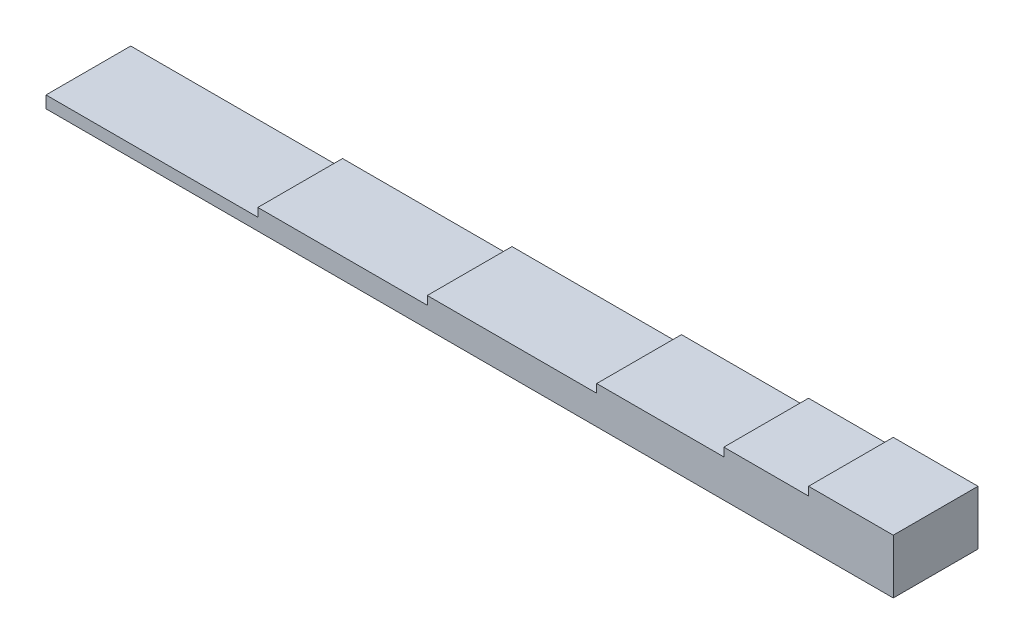
ISO-10303-21;
HEADER;
FILE_DESCRIPTION(('STEP AP214'),'2;1');
FILE_NAME('part.step','',(''),(''),'','','');
FILE_SCHEMA(('AUTOMOTIVE_DESIGN { 1 0 10303 214 1 1 1 1 }'));
ENDSEC;
DATA;
#1=APPLICATION_CONTEXT('core data for automotive mechanical design processes');
#2=APPLICATION_PROTOCOL_DEFINITION('international standard','automotive_design',2000,#1);
#3=PRODUCT_CONTEXT('',#1,'mechanical');
#4=PRODUCT('Part','Part','',(#3));
#5=PRODUCT_RELATED_PRODUCT_CATEGORY('part','',(#4));
#6=PRODUCT_DEFINITION_FORMATION('','',#4);
#7=PRODUCT_DEFINITION_CONTEXT('part definition',#1,'design');
#8=PRODUCT_DEFINITION('design','',#6,#7);
#9=PRODUCT_DEFINITION_SHAPE('','',#8);
#10=(LENGTH_UNIT() NAMED_UNIT(*) SI_UNIT(.MILLI.,.METRE.));
#11=(NAMED_UNIT(*) PLANE_ANGLE_UNIT() SI_UNIT($,.RADIAN.));
#12=(NAMED_UNIT(*) SI_UNIT($,.STERADIAN.) SOLID_ANGLE_UNIT());
#13=UNCERTAINTY_MEASURE_WITH_UNIT(LENGTH_MEASURE(1.E-05),#10,'distance_accuracy_value','');
#14=(GEOMETRIC_REPRESENTATION_CONTEXT(3) GLOBAL_UNCERTAINTY_ASSIGNED_CONTEXT((#13)) GLOBAL_UNIT_ASSIGNED_CONTEXT((#10,
#11,#12)) REPRESENTATION_CONTEXT('',''));
#15=CARTESIAN_POINT('',(0.,0.,0.));
#16=DIRECTION('',(0.,0.,1.));
#17=DIRECTION('',(1.,0.,0.));
#18=AXIS2_PLACEMENT_3D('',#15,#16,#17);
#19=CARTESIAN_POINT('',(75.,0.,10.));
#20=DIRECTION('',(1.,0.,0.));
#21=DIRECTION('',(0.,0.,-1.));
#22=AXIS2_PLACEMENT_3D('',#19,#20,#21);
#23=PLANE('',#22);
#24=DIRECTION('',(0.,-1.,0.));
#25=VECTOR('',#24,1.);
#26=CARTESIAN_POINT('',(75.,0.,0.));
#27=LINE('',#26,#25);
#28=CARTESIAN_POINT('',(75.,4.,0.));
#29=VERTEX_POINT('',#28);
#30=CARTESIAN_POINT('',(75.,-2.42151928856505,0.));
#31=VERTEX_POINT('',#30);
#32=EDGE_CURVE('E135',#29,#31,#27,.T.);
#33=ORIENTED_EDGE('',*,*,#32,.F.);
#34=DIRECTION('',(0.,0.,-1.));
#35=VECTOR('',#34,1.);
#36=CARTESIAN_POINT('',(75.,4.,10.));
#37=LINE('',#36,#35);
#38=CARTESIAN_POINT('',(75.,4.,10.));
#39=VERTEX_POINT('',#38);
#40=EDGE_CURVE('E11',#39,#29,#37,.T.);
#41=ORIENTED_EDGE('',*,*,#40,.F.);
#42=DIRECTION('',(0.,-1.,0.));
#43=VECTOR('',#42,1.);
#44=CARTESIAN_POINT('',(75.,0.,10.));
#45=LINE('',#44,#43);
#46=CARTESIAN_POINT('',(75.,-2.42151928856505,10.));
#47=VERTEX_POINT('',#46);
#48=EDGE_CURVE('E231',#39,#47,#45,.T.);
#49=ORIENTED_EDGE('',*,*,#48,.T.);
#50=DIRECTION('',(0.,0.,-1.));
#51=VECTOR('',#50,1.);
#52=CARTESIAN_POINT('',(75.,-2.42151928856505,10.));
#53=LINE('',#52,#51);
#54=EDGE_CURVE('E147',#47,#31,#53,.T.);
#55=ORIENTED_EDGE('',*,*,#54,.T.);
#56=EDGE_LOOP('',(#33,#41,#49,#55));
#57=FACE_BOUND('',#56,.T.);
#58=ADVANCED_FACE('F39',(#57),#23,.T.);
#59=CARTESIAN_POINT('',(0.,3.99999999999999,10.));
#60=DIRECTION('',(0.,1.,0.));
#61=DIRECTION('',(-1.,0.,0.));
#62=AXIS2_PLACEMENT_3D('',#59,#60,#61);
#63=PLANE('',#62);
#64=DIRECTION('',(1.,0.,0.));
#65=VECTOR('',#64,1.);
#66=CARTESIAN_POINT('',(0.,3.99999999999999,0.));
#67=LINE('',#66,#65);
#68=CARTESIAN_POINT('',(65.,4.,0.));
#69=VERTEX_POINT('',#68);
#70=EDGE_CURVE('E199',#69,#29,#67,.T.);
#71=ORIENTED_EDGE('',*,*,#70,.F.);
#72=DIRECTION('',(0.,0.,-1.));
#73=VECTOR('',#72,1.);
#74=CARTESIAN_POINT('',(65.,4.,10.));
#75=LINE('',#74,#73);
#76=CARTESIAN_POINT('',(65.,4.,10.));
#77=VERTEX_POINT('',#76);
#78=EDGE_CURVE('E49',#77,#69,#75,.T.);
#79=ORIENTED_EDGE('',*,*,#78,.F.);
#80=DIRECTION('',(1.,0.,0.));
#81=VECTOR('',#80,1.);
#82=CARTESIAN_POINT('',(0.,3.99999999999999,10.));
#83=LINE('',#82,#81);
#84=EDGE_CURVE('E228',#77,#39,#83,.T.);
#85=ORIENTED_EDGE('',*,*,#84,.T.);
#86=ORIENTED_EDGE('',*,*,#40,.T.);
#87=EDGE_LOOP('',(#71,#79,#85,#86));
#88=FACE_BOUND('',#87,.T.);
#89=ADVANCED_FACE('F280',(#88),#63,.T.);
#90=CARTESIAN_POINT('',(65.,9.02056207507941E-13,10.));
#91=DIRECTION('',(-1.,0.,0.));
#92=DIRECTION('',(0.,-1.,0.));
#93=AXIS2_PLACEMENT_3D('',#90,#91,#92);
#94=PLANE('',#93);
#95=DIRECTION('',(0.,1.,0.));
#96=VECTOR('',#95,1.);
#97=CARTESIAN_POINT('',(65.,9.02056207507941E-13,0.));
#98=LINE('',#97,#96);
#99=CARTESIAN_POINT('',(65.,3.,0.));
#100=VERTEX_POINT('',#99);
#101=EDGE_CURVE('E196',#100,#69,#98,.T.);
#102=ORIENTED_EDGE('',*,*,#101,.F.);
#103=DIRECTION('',(0.,0.,-1.));
#104=VECTOR('',#103,1.);
#105=CARTESIAN_POINT('',(65.,3.,10.));
#106=LINE('',#105,#104);
#107=CARTESIAN_POINT('',(65.,3.,10.));
#108=VERTEX_POINT('',#107);
#109=EDGE_CURVE('E157',#108,#100,#106,.T.);
#110=ORIENTED_EDGE('',*,*,#109,.F.);
#111=DIRECTION('',(0.,1.,0.));
#112=VECTOR('',#111,1.);
#113=CARTESIAN_POINT('',(65.,9.02056207507941E-13,10.));
#114=LINE('',#113,#112);
#115=EDGE_CURVE('E225',#108,#77,#114,.T.);
#116=ORIENTED_EDGE('',*,*,#115,.T.);
#117=ORIENTED_EDGE('',*,*,#78,.T.);
#118=EDGE_LOOP('',(#102,#110,#116,#117));
#119=FACE_BOUND('',#118,.T.);
#120=ADVANCED_FACE('F283',(#119),#94,.T.);
#121=CARTESIAN_POINT('',(0.,3.,10.));
#122=DIRECTION('',(0.,1.,0.));
#123=DIRECTION('',(0.,0.,1.));
#124=AXIS2_PLACEMENT_3D('',#121,#122,#123);
#125=PLANE('',#124);
#126=DIRECTION('',(1.,0.,0.));
#127=VECTOR('',#126,1.);
#128=CARTESIAN_POINT('',(0.,3.,0.));
#129=LINE('',#128,#127);
#130=CARTESIAN_POINT('',(55.,3.,0.));
#131=VERTEX_POINT('',#130);
#132=EDGE_CURVE('E193',#131,#100,#129,.T.);
#133=ORIENTED_EDGE('',*,*,#132,.F.);
#134=DIRECTION('',(0.,0.,-1.));
#135=VECTOR('',#134,1.);
#136=CARTESIAN_POINT('',(55.,3.,10.));
#137=LINE('',#136,#135);
#138=CARTESIAN_POINT('',(55.,3.,10.));
#139=VERTEX_POINT('',#138);
#140=EDGE_CURVE('E159',#139,#131,#137,.T.);
#141=ORIENTED_EDGE('',*,*,#140,.F.);
#142=DIRECTION('',(1.,0.,0.));
#143=VECTOR('',#142,1.);
#144=CARTESIAN_POINT('',(0.,3.,10.));
#145=LINE('',#144,#143);
#146=EDGE_CURVE('E222',#139,#108,#145,.T.);
#147=ORIENTED_EDGE('',*,*,#146,.T.);
#148=ORIENTED_EDGE('',*,*,#109,.T.);
#149=EDGE_LOOP('',(#133,#141,#147,#148));
#150=FACE_BOUND('',#149,.T.);
#151=ADVANCED_FACE('F288',(#150),#125,.T.);
#152=CARTESIAN_POINT('',(55.,0.,10.));
#153=DIRECTION('',(-1.,0.,0.));
#154=DIRECTION('',(0.,0.,1.));
#155=AXIS2_PLACEMENT_3D('',#152,#153,#154);
#156=PLANE('',#155);
#157=DIRECTION('',(0.,1.,0.));
#158=VECTOR('',#157,1.);
#159=CARTESIAN_POINT('',(55.,0.,0.));
#160=LINE('',#159,#158);
#161=CARTESIAN_POINT('',(55.,2.,0.));
#162=VERTEX_POINT('',#161);
#163=EDGE_CURVE('E190',#162,#131,#160,.T.);
#164=ORIENTED_EDGE('',*,*,#163,.F.);
#165=DIRECTION('',(0.,0.,-1.));
#166=VECTOR('',#165,1.);
#167=CARTESIAN_POINT('',(55.,2.,10.));
#168=LINE('',#167,#166);
#169=CARTESIAN_POINT('',(55.,2.,10.));
#170=VERTEX_POINT('',#169);
#171=EDGE_CURVE('E161',#170,#162,#168,.T.);
#172=ORIENTED_EDGE('',*,*,#171,.F.);
#173=DIRECTION('',(0.,1.,0.));
#174=VECTOR('',#173,1.);
#175=CARTESIAN_POINT('',(55.,0.,10.));
#176=LINE('',#175,#174);
#177=EDGE_CURVE('E219',#170,#139,#176,.T.);
#178=ORIENTED_EDGE('',*,*,#177,.T.);
#179=ORIENTED_EDGE('',*,*,#140,.T.);
#180=EDGE_LOOP('',(#164,#172,#178,#179));
#181=FACE_BOUND('',#180,.T.);
#182=ADVANCED_FACE('F291',(#181),#156,.T.);
#183=CARTESIAN_POINT('',(0.,2.,10.));
#184=DIRECTION('',(0.,1.,0.));
#185=DIRECTION('',(-1.,0.,0.));
#186=AXIS2_PLACEMENT_3D('',#183,#184,#185);
#187=PLANE('',#186);
#188=DIRECTION('',(1.,0.,0.));
#189=VECTOR('',#188,1.);
#190=CARTESIAN_POINT('',(0.,2.,0.));
#191=LINE('',#190,#189);
#192=CARTESIAN_POINT('',(40.,2.,0.));
#193=VERTEX_POINT('',#192);
#194=EDGE_CURVE('E187',#193,#162,#191,.T.);
#195=ORIENTED_EDGE('',*,*,#194,.F.);
#196=DIRECTION('',(0.,0.,-1.));
#197=VECTOR('',#196,1.);
#198=CARTESIAN_POINT('',(40.,2.,10.));
#199=LINE('',#198,#197);
#200=CARTESIAN_POINT('',(40.,2.,10.));
#201=VERTEX_POINT('',#200);
#202=EDGE_CURVE('E163',#201,#193,#199,.T.);
#203=ORIENTED_EDGE('',*,*,#202,.F.);
#204=DIRECTION('',(1.,0.,0.));
#205=VECTOR('',#204,1.);
#206=CARTESIAN_POINT('',(0.,2.,10.));
#207=LINE('',#206,#205);
#208=EDGE_CURVE('E216',#201,#170,#207,.T.);
#209=ORIENTED_EDGE('',*,*,#208,.T.);
#210=ORIENTED_EDGE('',*,*,#171,.T.);
#211=EDGE_LOOP('',(#195,#203,#209,#210));
#212=FACE_BOUND('',#211,.T.);
#213=ADVANCED_FACE('F296',(#212),#187,.T.);
#214=CARTESIAN_POINT('',(40.,-5.55111512312578E-13,10.));
#215=DIRECTION('',(-1.,0.,0.));
#216=DIRECTION('',(0.,-1.,0.));
#217=AXIS2_PLACEMENT_3D('',#214,#215,#216);
#218=PLANE('',#217);
#219=DIRECTION('',(0.,1.,0.));
#220=VECTOR('',#219,1.);
#221=CARTESIAN_POINT('',(40.,-5.55111512312578E-13,0.));
#222=LINE('',#221,#220);
#223=CARTESIAN_POINT('',(40.,1.,0.));
#224=VERTEX_POINT('',#223);
#225=EDGE_CURVE('E184',#224,#193,#222,.T.);
#226=ORIENTED_EDGE('',*,*,#225,.F.);
#227=DIRECTION('',(0.,0.,-1.));
#228=VECTOR('',#227,1.);
#229=CARTESIAN_POINT('',(40.,1.,10.));
#230=LINE('',#229,#228);
#231=CARTESIAN_POINT('',(40.,1.,10.));
#232=VERTEX_POINT('',#231);
#233=EDGE_CURVE('E165',#232,#224,#230,.T.);
#234=ORIENTED_EDGE('',*,*,#233,.F.);
#235=DIRECTION('',(0.,1.,0.));
#236=VECTOR('',#235,1.);
#237=CARTESIAN_POINT('',(40.,-5.55111512312578E-13,10.));
#238=LINE('',#237,#236);
#239=EDGE_CURVE('E213',#232,#201,#238,.T.);
#240=ORIENTED_EDGE('',*,*,#239,.T.);
#241=ORIENTED_EDGE('',*,*,#202,.T.);
#242=EDGE_LOOP('',(#226,#234,#240,#241));
#243=FACE_BOUND('',#242,.T.);
#244=ADVANCED_FACE('F299',(#243),#218,.T.);
#245=CARTESIAN_POINT('',(0.,1.,10.));
#246=DIRECTION('',(0.,1.,0.));
#247=DIRECTION('',(-1.,0.,0.));
#248=AXIS2_PLACEMENT_3D('',#245,#246,#247);
#249=PLANE('',#248);
#250=DIRECTION('',(1.,0.,0.));
#251=VECTOR('',#250,1.);
#252=CARTESIAN_POINT('',(0.,1.,0.));
#253=LINE('',#252,#251);
#254=CARTESIAN_POINT('',(20.,1.,0.));
#255=VERTEX_POINT('',#254);
#256=EDGE_CURVE('E181',#255,#224,#253,.T.);
#257=ORIENTED_EDGE('',*,*,#256,.F.);
#258=DIRECTION('',(0.,0.,-1.));
#259=VECTOR('',#258,1.);
#260=CARTESIAN_POINT('',(20.,1.,10.));
#261=LINE('',#260,#259);
#262=CARTESIAN_POINT('',(20.,1.,10.));
#263=VERTEX_POINT('',#262);
#264=EDGE_CURVE('E167',#263,#255,#261,.T.);
#265=ORIENTED_EDGE('',*,*,#264,.F.);
#266=DIRECTION('',(1.,0.,0.));
#267=VECTOR('',#266,1.);
#268=CARTESIAN_POINT('',(0.,1.,10.));
#269=LINE('',#268,#267);
#270=EDGE_CURVE('E210',#263,#232,#269,.T.);
#271=ORIENTED_EDGE('',*,*,#270,.T.);
#272=ORIENTED_EDGE('',*,*,#233,.T.);
#273=EDGE_LOOP('',(#257,#265,#271,#272));
#274=FACE_BOUND('',#273,.T.);
#275=ADVANCED_FACE('F302',(#274),#249,.T.);
#276=CARTESIAN_POINT('',(20.,0.,10.));
#277=DIRECTION('',(-1.,0.,0.));
#278=DIRECTION('',(0.,0.,1.));
#279=AXIS2_PLACEMENT_3D('',#276,#277,#278);
#280=PLANE('',#279);
#281=DIRECTION('',(0.,1.,0.));
#282=VECTOR('',#281,1.);
#283=CARTESIAN_POINT('',(20.,0.,0.));
#284=LINE('',#283,#282);
#285=CARTESIAN_POINT('',(20.,0.,0.));
#286=VERTEX_POINT('',#285);
#287=EDGE_CURVE('E178',#286,#255,#284,.T.);
#288=ORIENTED_EDGE('',*,*,#287,.F.);
#289=DIRECTION('',(0.,0.,-1.));
#290=VECTOR('',#289,1.);
#291=CARTESIAN_POINT('',(20.,0.,10.));
#292=LINE('',#291,#290);
#293=CARTESIAN_POINT('',(20.,0.,10.));
#294=VERTEX_POINT('',#293);
#295=EDGE_CURVE('E169',#294,#286,#292,.T.);
#296=ORIENTED_EDGE('',*,*,#295,.F.);
#297=DIRECTION('',(0.,1.,0.));
#298=VECTOR('',#297,1.);
#299=CARTESIAN_POINT('',(20.,0.,10.));
#300=LINE('',#299,#298);
#301=EDGE_CURVE('E207',#294,#263,#300,.T.);
#302=ORIENTED_EDGE('',*,*,#301,.T.);
#303=ORIENTED_EDGE('',*,*,#264,.T.);
#304=EDGE_LOOP('',(#288,#296,#302,#303));
#305=FACE_BOUND('',#304,.T.);
#306=ADVANCED_FACE('F303',(#305),#280,.T.);
#307=CARTESIAN_POINT('',(0.,0.,10.));
#308=DIRECTION('',(0.,1.,0.));
#309=DIRECTION('',(0.,0.,1.));
#310=AXIS2_PLACEMENT_3D('',#307,#308,#309);
#311=PLANE('',#310);
#312=DIRECTION('',(1.,0.,0.));
#313=VECTOR('',#312,1.);
#314=CARTESIAN_POINT('',(0.,0.,0.));
#315=LINE('',#314,#313);
#316=CARTESIAN_POINT('',(0.,0.,0.));
#317=VERTEX_POINT('',#316);
#318=EDGE_CURVE('E174',#317,#286,#315,.T.);
#319=ORIENTED_EDGE('',*,*,#318,.F.);
#320=DIRECTION('',(0.,0.,-1.));
#321=VECTOR('',#320,1.);
#322=CARTESIAN_POINT('',(0.,0.,10.));
#323=LINE('',#322,#321);
#324=CARTESIAN_POINT('',(0.,0.,10.));
#325=VERTEX_POINT('',#324);
#326=EDGE_CURVE('E171',#325,#317,#323,.T.);
#327=ORIENTED_EDGE('',*,*,#326,.F.);
#328=DIRECTION('',(1.,0.,0.));
#329=VECTOR('',#328,1.);
#330=CARTESIAN_POINT('',(0.,0.,10.));
#331=LINE('',#330,#329);
#332=EDGE_CURVE('E203',#325,#294,#331,.T.);
#333=ORIENTED_EDGE('',*,*,#332,.T.);
#334=ORIENTED_EDGE('',*,*,#295,.T.);
#335=EDGE_LOOP('',(#319,#327,#333,#334));
#336=FACE_BOUND('',#335,.T.);
#337=ADVANCED_FACE('F248',(#336),#311,.T.);
#338=CARTESIAN_POINT('',(0.,0.,10.));
#339=DIRECTION('',(-1.,0.,0.));
#340=DIRECTION('',(0.,0.,1.));
#341=AXIS2_PLACEMENT_3D('',#338,#339,#340);
#342=PLANE('',#341);
#343=DIRECTION('',(0.,1.,0.));
#344=VECTOR('',#343,1.);
#345=CARTESIAN_POINT('',(0.,0.,0.));
#346=LINE('',#345,#344);
#347=CARTESIAN_POINT('',(0.,-1.,0.));
#348=VERTEX_POINT('',#347);
#349=EDGE_CURVE('E177',#348,#317,#346,.T.);
#350=ORIENTED_EDGE('',*,*,#349,.F.);
#351=DIRECTION('',(0.,0.,-1.));
#352=VECTOR('',#351,1.);
#353=CARTESIAN_POINT('',(0.,-1.,10.));
#354=LINE('',#353,#352);
#355=CARTESIAN_POINT('',(0.,-1.,10.));
#356=VERTEX_POINT('',#355);
#357=EDGE_CURVE('E58',#356,#348,#354,.T.);
#358=ORIENTED_EDGE('',*,*,#357,.F.);
#359=DIRECTION('',(0.,1.,0.));
#360=VECTOR('',#359,1.);
#361=CARTESIAN_POINT('',(0.,0.,10.));
#362=LINE('',#361,#360);
#363=EDGE_CURVE('E206',#356,#325,#362,.T.);
#364=ORIENTED_EDGE('',*,*,#363,.T.);
#365=ORIENTED_EDGE('',*,*,#326,.T.);
#366=EDGE_LOOP('',(#350,#358,#364,#365));
#367=FACE_BOUND('',#366,.T.);
#368=ADVANCED_FACE('F240',(#367),#342,.T.);
#369=CARTESIAN_POINT('',(0.,0.,10.));
#370=DIRECTION('',(0.,0.,1.));
#371=DIRECTION('',(1.,0.,0.));
#372=AXIS2_PLACEMENT_3D('',#369,#370,#371);
#373=PLANE('',#372);
#374=ORIENTED_EDGE('',*,*,#363,.F.);
#375=DIRECTION('',(-1.,0.,0.));
#376=VECTOR('',#375,1.);
#377=CARTESIAN_POINT('',(75.,-1.00000000000001,10.));
#378=LINE('',#377,#376);
#379=CARTESIAN_POINT('',(-25.,-1.00000000000002,10.));
#380=VERTEX_POINT('',#379);
#381=EDGE_CURVE('E148',#356,#380,#378,.T.);
#382=ORIENTED_EDGE('',*,*,#381,.T.);
#383=DIRECTION('',(0.,-1.,0.));
#384=VECTOR('',#383,1.);
#385=CARTESIAN_POINT('',(-25.,-1.00000000000002,10.));
#386=LINE('',#385,#384);
#387=CARTESIAN_POINT('',(-25.,-2.42151928856507,10.));
#388=VERTEX_POINT('',#387);
#389=EDGE_CURVE('E134',#380,#388,#386,.T.);
#390=ORIENTED_EDGE('',*,*,#389,.T.);
#391=DIRECTION('',(-1.,0.,0.));
#392=VECTOR('',#391,1.);
#393=CARTESIAN_POINT('',(75.,-2.42151928856505,10.));
#394=LINE('',#393,#392);
#395=EDGE_CURVE('E128',#47,#388,#394,.T.);
#396=ORIENTED_EDGE('',*,*,#395,.F.);
#397=ORIENTED_EDGE('',*,*,#48,.F.);
#398=ORIENTED_EDGE('',*,*,#84,.F.);
#399=ORIENTED_EDGE('',*,*,#115,.F.);
#400=ORIENTED_EDGE('',*,*,#146,.F.);
#401=ORIENTED_EDGE('',*,*,#177,.F.);
#402=ORIENTED_EDGE('',*,*,#208,.F.);
#403=ORIENTED_EDGE('',*,*,#239,.F.);
#404=ORIENTED_EDGE('',*,*,#270,.F.);
#405=ORIENTED_EDGE('',*,*,#301,.F.);
#406=ORIENTED_EDGE('',*,*,#332,.F.);
#407=EDGE_LOOP('',(#374,#382,#390,#396,#397,#398,#399,#400,#401,#402,#403,#404,#405,#406));
#408=FACE_BOUND('',#407,.T.);
#409=ADVANCED_FACE('F244',(#408),#373,.T.);
#410=CARTESIAN_POINT('',(0.,0.,0.));
#411=DIRECTION('',(0.,0.,1.));
#412=DIRECTION('',(1.,0.,0.));
#413=AXIS2_PLACEMENT_3D('',#410,#411,#412);
#414=PLANE('',#413);
#415=ORIENTED_EDGE('',*,*,#32,.T.);
#416=DIRECTION('',(-1.,0.,0.));
#417=VECTOR('',#416,1.);
#418=CARTESIAN_POINT('',(75.,-2.42151928856505,0.));
#419=LINE('',#418,#417);
#420=CARTESIAN_POINT('',(-25.,-2.42151928856507,0.));
#421=VERTEX_POINT('',#420);
#422=EDGE_CURVE('E138',#31,#421,#419,.T.);
#423=ORIENTED_EDGE('',*,*,#422,.T.);
#424=DIRECTION('',(0.,-1.,0.));
#425=VECTOR('',#424,1.);
#426=CARTESIAN_POINT('',(-25.,-1.00000000000002,0.));
#427=LINE('',#426,#425);
#428=CARTESIAN_POINT('',(-25.,-1.00000000000002,0.));
#429=VERTEX_POINT('',#428);
#430=EDGE_CURVE('E129',#429,#421,#427,.T.);
#431=ORIENTED_EDGE('',*,*,#430,.F.);
#432=DIRECTION('',(-1.,0.,0.));
#433=VECTOR('',#432,1.);
#434=CARTESIAN_POINT('',(75.,-1.00000000000001,0.));
#435=LINE('',#434,#433);
#436=EDGE_CURVE('E120',#348,#429,#435,.T.);
#437=ORIENTED_EDGE('',*,*,#436,.F.);
#438=ORIENTED_EDGE('',*,*,#349,.T.);
#439=ORIENTED_EDGE('',*,*,#318,.T.);
#440=ORIENTED_EDGE('',*,*,#287,.T.);
#441=ORIENTED_EDGE('',*,*,#256,.T.);
#442=ORIENTED_EDGE('',*,*,#225,.T.);
#443=ORIENTED_EDGE('',*,*,#194,.T.);
#444=ORIENTED_EDGE('',*,*,#163,.T.);
#445=ORIENTED_EDGE('',*,*,#132,.T.);
#446=ORIENTED_EDGE('',*,*,#101,.T.);
#447=ORIENTED_EDGE('',*,*,#70,.T.);
#448=EDGE_LOOP('',(#415,#423,#431,#437,#438,#439,#440,#441,#442,#443,#444,#445,#446,#447));
#449=FACE_BOUND('',#448,.T.);
#450=ADVANCED_FACE('F137',(#449),#414,.F.);
#451=CARTESIAN_POINT('',(75.,-2.42151928856505,10.));
#452=DIRECTION('',(0.,-1.,0.));
#453=DIRECTION('',(1.,0.,0.));
#454=AXIS2_PLACEMENT_3D('',#451,#452,#453);
#455=PLANE('',#454);
#456=ORIENTED_EDGE('',*,*,#422,.F.);
#457=ORIENTED_EDGE('',*,*,#54,.F.);
#458=ORIENTED_EDGE('',*,*,#395,.T.);
#459=DIRECTION('',(0.,0.,-1.));
#460=VECTOR('',#459,1.);
#461=CARTESIAN_POINT('',(-25.,-2.42151928856507,10.));
#462=LINE('',#461,#460);
#463=EDGE_CURVE('E114',#388,#421,#462,.T.);
#464=ORIENTED_EDGE('',*,*,#463,.T.);
#465=EDGE_LOOP('',(#456,#457,#458,#464));
#466=FACE_BOUND('',#465,.T.);
#467=ADVANCED_FACE('F41',(#466),#455,.T.);
#468=CARTESIAN_POINT('',(-25.,-1.00000000000002,10.));
#469=DIRECTION('',(1.,0.,0.));
#470=DIRECTION('',(0.,0.,-1.));
#471=AXIS2_PLACEMENT_3D('',#468,#469,#470);
#472=PLANE('',#471);
#473=ORIENTED_EDGE('',*,*,#430,.T.);
#474=ORIENTED_EDGE('',*,*,#463,.F.);
#475=ORIENTED_EDGE('',*,*,#389,.F.);
#476=DIRECTION('',(0.,0.,-1.));
#477=VECTOR('',#476,1.);
#478=CARTESIAN_POINT('',(-25.,-1.00000000000002,10.));
#479=LINE('',#478,#477);
#480=EDGE_CURVE('E123',#380,#429,#479,.T.);
#481=ORIENTED_EDGE('',*,*,#480,.T.);
#482=EDGE_LOOP('',(#473,#474,#475,#481));
#483=FACE_BOUND('',#482,.T.);
#484=ADVANCED_FACE('F132',(#483),#472,.F.);
#485=CARTESIAN_POINT('',(75.,-1.00000000000001,10.));
#486=DIRECTION('',(0.,-1.,0.));
#487=DIRECTION('',(1.,0.,0.));
#488=AXIS2_PLACEMENT_3D('',#485,#486,#487);
#489=PLANE('',#488);
#490=ORIENTED_EDGE('',*,*,#381,.F.);
#491=ORIENTED_EDGE('',*,*,#357,.T.);
#492=ORIENTED_EDGE('',*,*,#436,.T.);
#493=ORIENTED_EDGE('',*,*,#480,.F.);
#494=EDGE_LOOP('',(#490,#491,#492,#493));
#495=FACE_BOUND('',#494,.T.);
#496=ADVANCED_FACE('F122',(#495),#489,.F.);
#497=CLOSED_SHELL('',(#58,#89,#120,#151,#182,#213,#244,#275,#306,#337,#368,#409,#450,#467,#484,#496));
#498=MANIFOLD_SOLID_BREP('B2',#497);
#499=ADVANCED_BREP_SHAPE_REPRESENTATION('',(#18,#498),#14);
#500=SHAPE_DEFINITION_REPRESENTATION(#9,#499);
ENDSEC;
END-ISO-10303-21;
